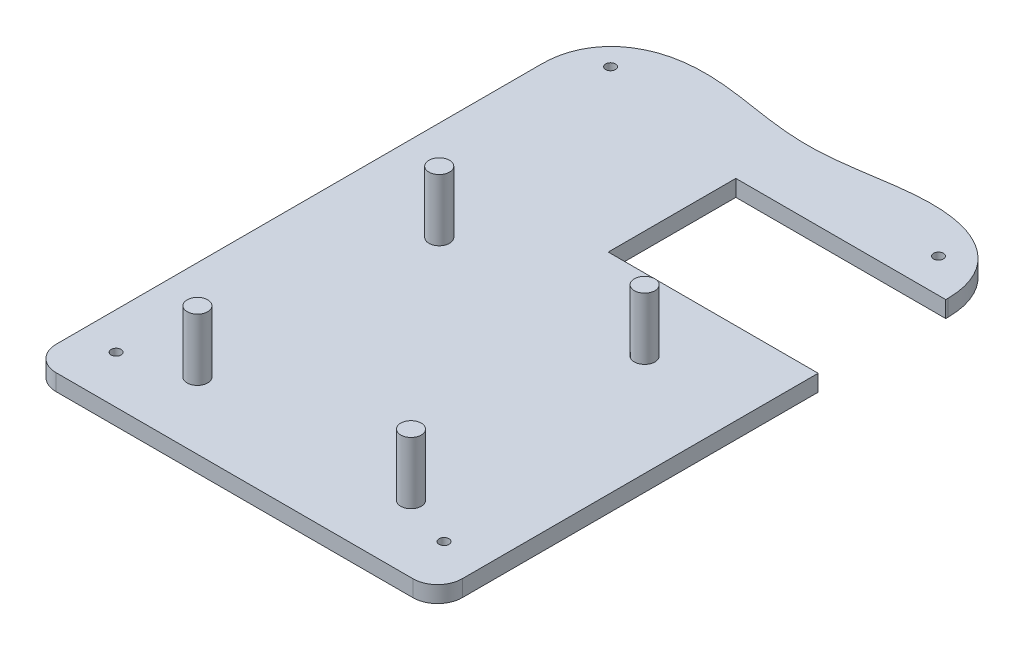
ISO-10303-21;
HEADER;
FILE_DESCRIPTION(('STEP AP214'),'2;1');
FILE_NAME('part.step','',(''),(''),'','','');
FILE_SCHEMA(('AUTOMOTIVE_DESIGN { 1 0 10303 214 1 1 1 1 }'));
ENDSEC;
DATA;
#1=APPLICATION_CONTEXT('core data for automotive mechanical design processes');
#2=APPLICATION_PROTOCOL_DEFINITION('international standard','automotive_design',2000,#1);
#3=PRODUCT_CONTEXT('',#1,'mechanical');
#4=PRODUCT('Part','Part','',(#3));
#5=PRODUCT_RELATED_PRODUCT_CATEGORY('part','',(#4));
#6=PRODUCT_DEFINITION_FORMATION('','',#4);
#7=PRODUCT_DEFINITION_CONTEXT('part definition',#1,'design');
#8=PRODUCT_DEFINITION('design','',#6,#7);
#9=PRODUCT_DEFINITION_SHAPE('','',#8);
#10=(LENGTH_UNIT() NAMED_UNIT(*) SI_UNIT(.MILLI.,.METRE.));
#11=(NAMED_UNIT(*) PLANE_ANGLE_UNIT() SI_UNIT($,.RADIAN.));
#12=(NAMED_UNIT(*) SI_UNIT($,.STERADIAN.) SOLID_ANGLE_UNIT());
#13=UNCERTAINTY_MEASURE_WITH_UNIT(LENGTH_MEASURE(1.E-05),#10,'distance_accuracy_value','');
#14=(GEOMETRIC_REPRESENTATION_CONTEXT(3) GLOBAL_UNCERTAINTY_ASSIGNED_CONTEXT((#13)) GLOBAL_UNIT_ASSIGNED_CONTEXT((#10,
#11,#12)) REPRESENTATION_CONTEXT('',''));
#15=CARTESIAN_POINT('',(0.,0.,0.));
#16=DIRECTION('',(0.,0.,1.));
#17=DIRECTION('',(1.,0.,0.));
#18=AXIS2_PLACEMENT_3D('',#15,#16,#17);
#19=CARTESIAN_POINT('',(100.76977648892,0.,-14.2329809142949));
#20=DIRECTION('',(0.,1.,0.));
#21=DIRECTION('',(0.,0.,1.));
#22=AXIS2_PLACEMENT_3D('',#19,#20,#21);
#23=PLANE('',#22);
#24=CARTESIAN_POINT('',(17.0587069179788,0.,-139.962329176477));
#25=DIRECTION('',(0.,-1.,0.));
#26=DIRECTION('',(0.,0.,-1.));
#27=AXIS2_PLACEMENT_3D('',#24,#25,#26);
#28=CIRCLE('',#27,2.2);
#29=CARTESIAN_POINT('',(17.0587069179788,0.,-142.162329176477));
#30=VERTEX_POINT('',#29);
#31=EDGE_CURVE('E191',#30,#30,#28,.T.);
#32=ORIENTED_EDGE('',*,*,#31,.F.);
#33=EDGE_LOOP('',(#32));
#34=FACE_BOUND('',#33,.T.);
#35=CARTESIAN_POINT('',(17.0587069179788,0.,-19.8367794215031));
#36=DIRECTION('',(0.,-1.,0.));
#37=DIRECTION('',(0.,0.,-1.));
#38=AXIS2_PLACEMENT_3D('',#35,#36,#37);
#39=CIRCLE('',#38,2.2);
#40=CARTESIAN_POINT('',(17.0587069179788,0.,-22.0367794215031));
#41=VERTEX_POINT('',#40);
#42=EDGE_CURVE('E195',#41,#41,#39,.T.);
#43=ORIENTED_EDGE('',*,*,#42,.F.);
#44=EDGE_LOOP('',(#43));
#45=FACE_BOUND('',#44,.T.);
#46=CARTESIAN_POINT('',(96.7401733982882,0.,-19.8367794215031));
#47=DIRECTION('',(0.,-1.,0.));
#48=DIRECTION('',(0.,0.,-1.));
#49=AXIS2_PLACEMENT_3D('',#46,#47,#48);
#50=CIRCLE('',#49,2.20000000000001);
#51=CARTESIAN_POINT('',(96.7401733982882,0.,-22.0367794215031));
#52=VERTEX_POINT('',#51);
#53=EDGE_CURVE('E199',#52,#52,#50,.T.);
#54=ORIENTED_EDGE('',*,*,#53,.F.);
#55=EDGE_LOOP('',(#54));
#56=FACE_BOUND('',#55,.T.);
#57=DIRECTION('',(0.,0.,1.));
#58=VECTOR('',#57,1.);
#59=CARTESIAN_POINT('',(55.7697764889205,0.,-14.2329809142949));
#60=LINE('',#59,#58);
#61=CARTESIAN_POINT('',(55.7697764889205,0.,-131.701924425202));
#62=VERTEX_POINT('',#61);
#63=CARTESIAN_POINT('',(55.7697764889205,0.,-100.701924425202));
#64=VERTEX_POINT('',#63);
#65=EDGE_CURVE('E48',#62,#64,#60,.T.);
#66=ORIENTED_EDGE('',*,*,#65,.T.);
#67=DIRECTION('',(1.,0.,0.));
#68=VECTOR('',#67,1.);
#69=CARTESIAN_POINT('',(100.76977648892,0.,-100.701924425202));
#70=LINE('',#69,#68);
#71=CARTESIAN_POINT('',(106.76977648892,0.,-100.701924425202));
#72=VERTEX_POINT('',#71);
#73=EDGE_CURVE('E11',#64,#72,#70,.T.);
#74=ORIENTED_EDGE('',*,*,#73,.T.);
#75=DIRECTION('',(0.,0.,1.));
#76=VECTOR('',#75,1.);
#77=CARTESIAN_POINT('',(106.76977648892,0.,-132.225547149591));
#78=LINE('',#77,#76);
#79=CARTESIAN_POINT('',(106.76977648892,0.,-14.2329809142949));
#80=VERTEX_POINT('',#79);
#81=EDGE_CURVE('E288',#72,#80,#78,.T.);
#82=ORIENTED_EDGE('',*,*,#81,.T.);
#83=CARTESIAN_POINT('',(100.76977648892,0.,-14.2329809142949));
#84=DIRECTION('',(0.,1.,0.));
#85=DIRECTION('',(0.,0.,1.));
#86=AXIS2_PLACEMENT_3D('',#83,#84,#85);
#87=CIRCLE('',#86,6.00000000000001);
#88=CARTESIAN_POINT('',(100.76977648892,0.,-8.23298091429488));
#89=VERTEX_POINT('',#88);
#90=EDGE_CURVE('E301',#89,#80,#87,.T.);
#91=ORIENTED_EDGE('',*,*,#90,.F.);
#92=DIRECTION('',(1.,0.,0.));
#93=VECTOR('',#92,1.);
#94=CARTESIAN_POINT('',(14.0910979071393,0.,-8.23298091429488));
#95=LINE('',#94,#93);
#96=CARTESIAN_POINT('',(14.0910979071393,0.,-8.23298091429488));
#97=VERTEX_POINT('',#96);
#98=EDGE_CURVE('E594',#97,#89,#95,.T.);
#99=ORIENTED_EDGE('',*,*,#98,.F.);
#100=CARTESIAN_POINT('',(14.0910979071393,0.,-14.2329809142949));
#101=DIRECTION('',(0.,1.,0.));
#102=DIRECTION('',(0.,0.,1.));
#103=AXIS2_PLACEMENT_3D('',#100,#101,#102);
#104=CIRCLE('',#103,6.);
#105=CARTESIAN_POINT('',(8.09109790713925,0.,-14.2329809142949));
#106=VERTEX_POINT('',#105);
#107=EDGE_CURVE('E606',#106,#97,#104,.T.);
#108=ORIENTED_EDGE('',*,*,#107,.F.);
#109=DIRECTION('',(0.,0.,1.));
#110=VECTOR('',#109,1.);
#111=CARTESIAN_POINT('',(8.09109790713925,0.,-132.236386797508));
#112=LINE('',#111,#110);
#113=CARTESIAN_POINT('',(8.09109790713925,0.,-132.236386797508));
#114=VERTEX_POINT('',#113);
#115=EDGE_CURVE('E129',#114,#106,#112,.T.);
#116=ORIENTED_EDGE('',*,*,#115,.F.);
#117=CARTESIAN_POINT('',(106.76977648892,0.,-132.225547149591));
#118=CARTESIAN_POINT('',(106.76977648892,0.,-159.234690285289));
#119=CARTESIAN_POINT('',(66.7697764889205,0.,-155.557917258713));
#120=CARTESIAN_POINT('',(71.3697764889205,0.,-140.524437357371));
#121=CARTESIAN_POINT('',(43.4910979071392,0.,-140.524437357371));
#122=CARTESIAN_POINT('',(48.0910979071393,0.,-155.557917258713));
#123=CARTESIAN_POINT('',(8.09109790713925,0.,-159.234690285289));
#124=CARTESIAN_POINT('',(8.09109790713925,0.,-132.236386797508));
#125=B_SPLINE_CURVE_WITH_KNOTS('',7,(#117,#118,#119,#120,#121,#122,#123,#124),.UNSPECIFIED.,.F.,
.F.,(8,8),(0.,1.),.UNSPECIFIED.);
#126=CARTESIAN_POINT('',(106.76977648892,0.,-132.225547149591));
#127=VERTEX_POINT('',#126);
#128=EDGE_CURVE('E590',#127,#114,#125,.T.);
#129=ORIENTED_EDGE('',*,*,#128,.F.);
#130=CARTESIAN_POINT('',(106.76977648892,0.,-131.701924425202));
#131=VERTEX_POINT('',#130);
#132=EDGE_CURVE('E153',#127,#131,#78,.T.);
#133=ORIENTED_EDGE('',*,*,#132,.T.);
#134=DIRECTION('',(-1.,0.,0.));
#135=VECTOR('',#134,1.);
#136=CARTESIAN_POINT('',(100.76977648892,0.,-131.701924425202));
#137=LINE('',#136,#135);
#138=EDGE_CURVE('E310',#131,#62,#137,.T.);
#139=ORIENTED_EDGE('',*,*,#138,.T.);
#140=EDGE_LOOP('',(#66,#74,#82,#91,#99,#108,#116,#129,#133,#139));
#141=FACE_BOUND('',#140,.T.);
#142=CARTESIAN_POINT('',(96.7401733982882,0.,-139.962329176477));
#143=DIRECTION('',(0.,-1.,0.));
#144=DIRECTION('',(0.,0.,-1.));
#145=AXIS2_PLACEMENT_3D('',#142,#143,#144);
#146=CIRCLE('',#145,2.20000000000001);
#147=CARTESIAN_POINT('',(96.7401733982882,0.,-142.162329176477));
#148=VERTEX_POINT('',#147);
#149=EDGE_CURVE('E206',#148,#148,#146,.T.);
#150=ORIENTED_EDGE('',*,*,#149,.F.);
#151=EDGE_LOOP('',(#150));
#152=FACE_BOUND('',#151,.T.);
#153=ADVANCED_FACE('F38',(#34,#45,#56,#141,#152),#23,.F.);
#154=CARTESIAN_POINT('',(106.76977648892,4.,-132.225547149591));
#155=DIRECTION('',(1.,0.,0.));
#156=DIRECTION('',(0.,0.,-1.));
#157=AXIS2_PLACEMENT_3D('',#154,#155,#156);
#158=PLANE('',#157);
#159=DIRECTION('',(0.,1.,0.));
#160=VECTOR('',#159,1.);
#161=CARTESIAN_POINT('',(106.76977648892,-11.,-100.701924425202));
#162=LINE('',#161,#160);
#163=CARTESIAN_POINT('',(106.76977648892,4.,-100.701924425202));
#164=VERTEX_POINT('',#163);
#165=EDGE_CURVE('E247',#72,#164,#162,.T.);
#166=ORIENTED_EDGE('',*,*,#165,.T.);
#167=DIRECTION('',(0.,0.,1.));
#168=VECTOR('',#167,1.);
#169=CARTESIAN_POINT('',(106.76977648892,4.,-132.225547149591));
#170=LINE('',#169,#168);
#171=CARTESIAN_POINT('',(106.76977648892,4.,-14.2329809142949));
#172=VERTEX_POINT('',#171);
#173=EDGE_CURVE('E98',#164,#172,#170,.T.);
#174=ORIENTED_EDGE('',*,*,#173,.T.);
#175=DIRECTION('',(0.,-1.,0.));
#176=VECTOR('',#175,1.);
#177=CARTESIAN_POINT('',(106.76977648892,4.,-14.2329809142949));
#178=LINE('',#177,#176);
#179=EDGE_CURVE('E152',#172,#80,#178,.T.);
#180=ORIENTED_EDGE('',*,*,#179,.T.);
#181=ORIENTED_EDGE('',*,*,#81,.F.);
#182=EDGE_LOOP('',(#166,#174,#180,#181));
#183=FACE_BOUND('',#182,.T.);
#184=ADVANCED_FACE('F182',(#183),#158,.T.);
#185=DIRECTION('',(0.,1.,0.));
#186=VECTOR('',#185,1.);
#187=CARTESIAN_POINT('',(106.76977648892,-11.,-131.701924425202));
#188=LINE('',#187,#186);
#189=CARTESIAN_POINT('',(106.76977648892,4.,-131.701924425202));
#190=VERTEX_POINT('',#189);
#191=EDGE_CURVE('E246',#131,#190,#188,.T.);
#192=ORIENTED_EDGE('',*,*,#191,.F.);
#193=ORIENTED_EDGE('',*,*,#132,.F.);
#194=DIRECTION('',(0.,-1.,0.));
#195=VECTOR('',#194,1.);
#196=CARTESIAN_POINT('',(106.76977648892,4.,-132.225547149591));
#197=LINE('',#196,#195);
#198=CARTESIAN_POINT('',(106.76977648892,4.,-132.225547149591));
#199=VERTEX_POINT('',#198);
#200=EDGE_CURVE('E65',#199,#127,#197,.T.);
#201=ORIENTED_EDGE('',*,*,#200,.F.);
#202=EDGE_CURVE('E292',#199,#190,#170,.T.);
#203=ORIENTED_EDGE('',*,*,#202,.T.);
#204=EDGE_LOOP('',(#192,#193,#201,#203));
#205=FACE_BOUND('',#204,.T.);
#206=ADVANCED_FACE('F40',(#205),#158,.T.);
#207=CARTESIAN_POINT('',(106.76977648892,4.,-132.225547149591));
#208=CARTESIAN_POINT('',(106.76977648892,4.,-159.234690285289));
#209=CARTESIAN_POINT('',(66.7697764889205,4.,-155.557917258713));
#210=CARTESIAN_POINT('',(71.3697764889205,4.,-140.524437357371));
#211=CARTESIAN_POINT('',(43.4910979071392,4.,-140.524437357371));
#212=CARTESIAN_POINT('',(48.0910979071393,4.,-155.557917258713));
#213=CARTESIAN_POINT('',(8.09109790713925,4.,-159.234690285289));
#214=CARTESIAN_POINT('',(8.09109790713925,4.,-132.236386797508));
#215=B_SPLINE_CURVE_WITH_KNOTS('',7,(#207,#208,#209,#210,#211,#212,#213,#214),.UNSPECIFIED.,.F.,
.F.,(8,8),(0.,1.),.UNSPECIFIED.);
#216=DIRECTION('',(0.,-1.,0.));
#217=VECTOR('',#216,1.);
#218=SURFACE_OF_LINEAR_EXTRUSION('',#215,#217);
#219=ORIENTED_EDGE('',*,*,#128,.T.);
#220=DIRECTION('',(0.,-1.,0.));
#221=VECTOR('',#220,1.);
#222=CARTESIAN_POINT('',(8.09109790713925,4.,-132.236386797508));
#223=LINE('',#222,#221);
#224=CARTESIAN_POINT('',(8.09109790713925,4.,-132.236386797508));
#225=VERTEX_POINT('',#224);
#226=EDGE_CURVE('E133',#225,#114,#223,.T.);
#227=ORIENTED_EDGE('',*,*,#226,.F.);
#228=EDGE_CURVE('E119',#199,#225,#215,.T.);
#229=ORIENTED_EDGE('',*,*,#228,.F.);
#230=ORIENTED_EDGE('',*,*,#200,.T.);
#231=EDGE_LOOP('',(#219,#227,#229,#230));
#232=FACE_BOUND('',#231,.T.);
#233=ADVANCED_FACE('F159',(#232),#218,.F.);
#234=CARTESIAN_POINT('',(8.09109790713925,4.,-132.236386797508));
#235=DIRECTION('',(1.,0.,0.));
#236=DIRECTION('',(0.,0.,-1.));
#237=AXIS2_PLACEMENT_3D('',#234,#235,#236);
#238=PLANE('',#237);
#239=ORIENTED_EDGE('',*,*,#115,.T.);
#240=DIRECTION('',(0.,-1.,0.));
#241=VECTOR('',#240,1.);
#242=CARTESIAN_POINT('',(8.09109790713925,4.,-14.2329809142949));
#243=LINE('',#242,#241);
#244=CARTESIAN_POINT('',(8.09109790713925,4.,-14.2329809142949));
#245=VERTEX_POINT('',#244);
#246=EDGE_CURVE('E126',#245,#106,#243,.T.);
#247=ORIENTED_EDGE('',*,*,#246,.F.);
#248=DIRECTION('',(0.,0.,1.));
#249=VECTOR('',#248,1.);
#250=CARTESIAN_POINT('',(8.09109790713925,4.,-132.236386797508));
#251=LINE('',#250,#249);
#252=EDGE_CURVE('E110',#225,#245,#251,.T.);
#253=ORIENTED_EDGE('',*,*,#252,.F.);
#254=ORIENTED_EDGE('',*,*,#226,.T.);
#255=EDGE_LOOP('',(#239,#247,#253,#254));
#256=FACE_BOUND('',#255,.T.);
#257=ADVANCED_FACE('F127',(#256),#238,.F.);
#258=CARTESIAN_POINT('',(14.0910979071393,4.,-14.2329809142949));
#259=DIRECTION('',(0.,-1.,0.));
#260=DIRECTION('',(0.,0.,-1.));
#261=AXIS2_PLACEMENT_3D('',#258,#259,#260);
#262=CYLINDRICAL_SURFACE('',#261,6.);
#263=ORIENTED_EDGE('',*,*,#107,.T.);
#264=DIRECTION('',(0.,-1.,0.));
#265=VECTOR('',#264,1.);
#266=CARTESIAN_POINT('',(14.0910979071393,4.,-8.23298091429488));
#267=LINE('',#266,#265);
#268=CARTESIAN_POINT('',(14.0910979071393,4.,-8.23298091429488));
#269=VERTEX_POINT('',#268);
#270=EDGE_CURVE('E134',#269,#97,#267,.T.);
#271=ORIENTED_EDGE('',*,*,#270,.F.);
#272=CARTESIAN_POINT('',(14.0910979071393,4.,-14.2329809142949));
#273=DIRECTION('',(0.,1.,0.));
#274=DIRECTION('',(0.,0.,1.));
#275=AXIS2_PLACEMENT_3D('',#272,#273,#274);
#276=CIRCLE('',#275,6.);
#277=EDGE_CURVE('E116',#245,#269,#276,.T.);
#278=ORIENTED_EDGE('',*,*,#277,.F.);
#279=ORIENTED_EDGE('',*,*,#246,.T.);
#280=EDGE_LOOP('',(#263,#271,#278,#279));
#281=FACE_BOUND('',#280,.T.);
#282=ADVANCED_FACE('F136',(#281),#262,.T.);
#283=CARTESIAN_POINT('',(14.0910979071393,4.,-8.23298091429488));
#284=DIRECTION('',(0.,0.,-1.));
#285=DIRECTION('',(-1.,0.,0.));
#286=AXIS2_PLACEMENT_3D('',#283,#284,#285);
#287=PLANE('',#286);
#288=ORIENTED_EDGE('',*,*,#98,.T.);
#289=DIRECTION('',(0.,-1.,0.));
#290=VECTOR('',#289,1.);
#291=CARTESIAN_POINT('',(100.76977648892,4.,-8.23298091429488));
#292=LINE('',#291,#290);
#293=CARTESIAN_POINT('',(100.76977648892,4.,-8.23298091429488));
#294=VERTEX_POINT('',#293);
#295=EDGE_CURVE('E304',#294,#89,#292,.T.);
#296=ORIENTED_EDGE('',*,*,#295,.F.);
#297=DIRECTION('',(1.,0.,0.));
#298=VECTOR('',#297,1.);
#299=CARTESIAN_POINT('',(14.0910979071393,4.,-8.23298091429488));
#300=LINE('',#299,#298);
#301=EDGE_CURVE('E140',#269,#294,#300,.T.);
#302=ORIENTED_EDGE('',*,*,#301,.F.);
#303=ORIENTED_EDGE('',*,*,#270,.T.);
#304=EDGE_LOOP('',(#288,#296,#302,#303));
#305=FACE_BOUND('',#304,.T.);
#306=ADVANCED_FACE('F168',(#305),#287,.F.);
#307=CARTESIAN_POINT('',(100.76977648892,4.,-14.2329809142949));
#308=DIRECTION('',(0.,-1.,0.));
#309=DIRECTION('',(0.,0.,-1.));
#310=AXIS2_PLACEMENT_3D('',#307,#308,#309);
#311=CYLINDRICAL_SURFACE('',#310,6.00000000000001);
#312=ORIENTED_EDGE('',*,*,#90,.T.);
#313=ORIENTED_EDGE('',*,*,#179,.F.);
#314=CARTESIAN_POINT('',(100.76977648892,4.,-14.2329809142949));
#315=DIRECTION('',(0.,1.,0.));
#316=DIRECTION('',(0.,0.,1.));
#317=AXIS2_PLACEMENT_3D('',#314,#315,#316);
#318=CIRCLE('',#317,6.00000000000001);
#319=EDGE_CURVE('E143',#294,#172,#318,.T.);
#320=ORIENTED_EDGE('',*,*,#319,.F.);
#321=ORIENTED_EDGE('',*,*,#295,.T.);
#322=EDGE_LOOP('',(#312,#313,#320,#321));
#323=FACE_BOUND('',#322,.T.);
#324=ADVANCED_FACE('F170',(#323),#311,.T.);
#325=CARTESIAN_POINT('',(100.76977648892,4.,-14.2329809142949));
#326=DIRECTION('',(0.,1.,0.));
#327=DIRECTION('',(0.,0.,1.));
#328=AXIS2_PLACEMENT_3D('',#325,#326,#327);
#329=PLANE('',#328);
#330=CARTESIAN_POINT('',(17.0587069179788,4.,-139.962329176477));
#331=DIRECTION('',(0.,1.,0.));
#332=DIRECTION('',(0.,0.,1.));
#333=AXIS2_PLACEMENT_3D('',#330,#331,#332);
#334=CIRCLE('',#333,1.19999999999999);
#335=CARTESIAN_POINT('',(17.0587069179788,4.,-138.762329176477));
#336=VERTEX_POINT('',#335);
#337=EDGE_CURVE('E42',#336,#336,#334,.T.);
#338=ORIENTED_EDGE('',*,*,#337,.F.);
#339=EDGE_LOOP('',(#338));
#340=FACE_BOUND('',#339,.T.);
#341=CARTESIAN_POINT('',(96.7401733982882,4.,-139.962329176477));
#342=DIRECTION('',(0.,1.,0.));
#343=DIRECTION('',(0.,0.,1.));
#344=AXIS2_PLACEMENT_3D('',#341,#342,#343);
#345=CIRCLE('',#344,1.19999999999999);
#346=CARTESIAN_POINT('',(96.7401733982882,4.,-138.762329176477));
#347=VERTEX_POINT('',#346);
#348=EDGE_CURVE('E214',#347,#347,#345,.T.);
#349=ORIENTED_EDGE('',*,*,#348,.F.);
#350=EDGE_LOOP('',(#349));
#351=FACE_BOUND('',#350,.T.);
#352=CARTESIAN_POINT('',(17.0587069179788,4.,-19.8367794215031));
#353=DIRECTION('',(0.,1.,0.));
#354=DIRECTION('',(0.,0.,1.));
#355=AXIS2_PLACEMENT_3D('',#352,#353,#354);
#356=CIRCLE('',#355,1.19999999999999);
#357=CARTESIAN_POINT('',(17.0587069179788,4.,-18.6367794215031));
#358=VERTEX_POINT('',#357);
#359=EDGE_CURVE('E227',#358,#358,#356,.T.);
#360=ORIENTED_EDGE('',*,*,#359,.F.);
#361=EDGE_LOOP('',(#360));
#362=FACE_BOUND('',#361,.T.);
#363=CARTESIAN_POINT('',(96.7401733982882,4.,-19.8367794215031));
#364=DIRECTION('',(0.,1.,0.));
#365=DIRECTION('',(0.,0.,1.));
#366=AXIS2_PLACEMENT_3D('',#363,#364,#365);
#367=CIRCLE('',#366,1.19999999999999);
#368=CARTESIAN_POINT('',(96.7401733982882,4.,-18.6367794215031));
#369=VERTEX_POINT('',#368);
#370=EDGE_CURVE('E234',#369,#369,#367,.T.);
#371=ORIENTED_EDGE('',*,*,#370,.F.);
#372=EDGE_LOOP('',(#371));
#373=FACE_BOUND('',#372,.T.);
#374=DIRECTION('',(1.,0.,0.));
#375=VECTOR('',#374,1.);
#376=CARTESIAN_POINT('',(106.76977648892,4.,-100.701924425202));
#377=LINE('',#376,#375);
#378=CARTESIAN_POINT('',(55.7697764889205,4.,-100.701924425202));
#379=VERTEX_POINT('',#378);
#380=EDGE_CURVE('E242',#379,#164,#377,.T.);
#381=ORIENTED_EDGE('',*,*,#380,.F.);
#382=DIRECTION('',(0.,0.,1.));
#383=VECTOR('',#382,1.);
#384=CARTESIAN_POINT('',(55.7697764889205,4.,-100.701924425202));
#385=LINE('',#384,#383);
#386=CARTESIAN_POINT('',(55.7697764889205,4.,-131.701924425202));
#387=VERTEX_POINT('',#386);
#388=EDGE_CURVE('E238',#387,#379,#385,.T.);
#389=ORIENTED_EDGE('',*,*,#388,.F.);
#390=DIRECTION('',(-1.,0.,0.));
#391=VECTOR('',#390,1.);
#392=CARTESIAN_POINT('',(106.76977648892,4.,-131.701924425202));
#393=LINE('',#392,#391);
#394=EDGE_CURVE('E235',#190,#387,#393,.T.);
#395=ORIENTED_EDGE('',*,*,#394,.F.);
#396=ORIENTED_EDGE('',*,*,#202,.F.);
#397=ORIENTED_EDGE('',*,*,#228,.T.);
#398=ORIENTED_EDGE('',*,*,#252,.T.);
#399=ORIENTED_EDGE('',*,*,#277,.T.);
#400=ORIENTED_EDGE('',*,*,#301,.T.);
#401=ORIENTED_EDGE('',*,*,#319,.T.);
#402=ORIENTED_EDGE('',*,*,#173,.F.);
#403=EDGE_LOOP('',(#381,#389,#395,#396,#397,#398,#399,#400,#401,#402));
#404=FACE_BOUND('',#403,.T.);
#405=CARTESIAN_POINT('',(84.0537083443801,4.,-24.4917491704997));
#406=DIRECTION('',(0.,1.,0.));
#407=DIRECTION('',(0.,0.,1.));
#408=AXIS2_PLACEMENT_3D('',#405,#406,#407);
#409=CIRCLE('',#408,2.50000000000001);
#410=CARTESIAN_POINT('',(84.0537083443801,4.,-21.9917491704997));
#411=VERTEX_POINT('',#410);
#412=EDGE_CURVE('E250',#411,#411,#409,.T.);
#413=ORIENTED_EDGE('',*,*,#412,.F.);
#414=EDGE_LOOP('',(#413));
#415=FACE_BOUND('',#414,.T.);
#416=CARTESIAN_POINT('',(32.1619729057827,4.,-24.4917491704997));
#417=DIRECTION('',(0.,1.,0.));
#418=DIRECTION('',(0.,0.,1.));
#419=AXIS2_PLACEMENT_3D('',#416,#417,#418);
#420=CIRCLE('',#419,2.5);
#421=CARTESIAN_POINT('',(32.1619729057827,4.,-21.9917491704997));
#422=VERTEX_POINT('',#421);
#423=EDGE_CURVE('E264',#422,#422,#420,.T.);
#424=ORIENTED_EDGE('',*,*,#423,.F.);
#425=EDGE_LOOP('',(#424));
#426=FACE_BOUND('',#425,.T.);
#427=CARTESIAN_POINT('',(82.0671898829709,4.,-83.2409286499744));
#428=DIRECTION('',(0.,1.,0.));
#429=DIRECTION('',(0.,0.,1.));
#430=AXIS2_PLACEMENT_3D('',#427,#428,#429);
#431=CIRCLE('',#430,2.5);
#432=CARTESIAN_POINT('',(82.0671898829709,4.,-80.7409286499744));
#433=VERTEX_POINT('',#432);
#434=EDGE_CURVE('E272',#433,#433,#431,.T.);
#435=ORIENTED_EDGE('',*,*,#434,.F.);
#436=EDGE_LOOP('',(#435));
#437=FACE_BOUND('',#436,.T.);
#438=CARTESIAN_POINT('',(32.1619729057827,4.,-83.2409286499744));
#439=DIRECTION('',(0.,1.,0.));
#440=DIRECTION('',(0.,0.,1.));
#441=AXIS2_PLACEMENT_3D('',#438,#439,#440);
#442=CIRCLE('',#441,2.5);
#443=CARTESIAN_POINT('',(32.1619729057827,4.,-80.7409286499744));
#444=VERTEX_POINT('',#443);
#445=EDGE_CURVE('E280',#444,#444,#442,.T.);
#446=ORIENTED_EDGE('',*,*,#445,.F.);
#447=EDGE_LOOP('',(#446));
#448=FACE_BOUND('',#447,.T.);
#449=ADVANCED_FACE('F113',(#340,#351,#362,#373,#404,#415,#426,#437,#448),#329,.T.);
#450=CARTESIAN_POINT('',(32.1619729057827,19.,-83.2409286499744));
#451=DIRECTION('',(0.,-1.,0.));
#452=DIRECTION('',(0.,0.,-1.));
#453=AXIS2_PLACEMENT_3D('',#450,#451,#452);
#454=CYLINDRICAL_SURFACE('',#453,2.5);
#455=CARTESIAN_POINT('',(32.1619729057827,19.,-83.2409286499744));
#456=DIRECTION('',(0.,1.,0.));
#457=DIRECTION('',(0.,0.,1.));
#458=AXIS2_PLACEMENT_3D('',#455,#456,#457);
#459=CIRCLE('',#458,2.5);
#460=CARTESIAN_POINT('',(32.1619729057827,19.,-80.7409286499744));
#461=VERTEX_POINT('',#460);
#462=EDGE_CURVE('E284',#461,#461,#459,.T.);
#463=ORIENTED_EDGE('',*,*,#462,.F.);
#464=EDGE_LOOP('',(#463));
#465=FACE_BOUND('',#464,.T.);
#466=ORIENTED_EDGE('',*,*,#445,.T.);
#467=EDGE_LOOP('',(#466));
#468=FACE_BOUND('',#467,.T.);
#469=ADVANCED_FACE('F178',(#465,#468),#454,.T.);
#470=CARTESIAN_POINT('',(32.1619729057827,19.,-83.2409286499744));
#471=DIRECTION('',(0.,1.,0.));
#472=DIRECTION('',(0.,0.,1.));
#473=AXIS2_PLACEMENT_3D('',#470,#471,#472);
#474=PLANE('',#473);
#475=ORIENTED_EDGE('',*,*,#462,.T.);
#476=EDGE_LOOP('',(#475));
#477=FACE_BOUND('',#476,.T.);
#478=ADVANCED_FACE('F385',(#477),#474,.T.);
#479=CARTESIAN_POINT('',(82.0671898829709,19.,-83.2409286499744));
#480=DIRECTION('',(0.,-1.,0.));
#481=DIRECTION('',(0.,0.,-1.));
#482=AXIS2_PLACEMENT_3D('',#479,#480,#481);
#483=CYLINDRICAL_SURFACE('',#482,2.5);
#484=CARTESIAN_POINT('',(82.0671898829709,19.,-83.2409286499744));
#485=DIRECTION('',(0.,1.,0.));
#486=DIRECTION('',(0.,0.,1.));
#487=AXIS2_PLACEMENT_3D('',#484,#485,#486);
#488=CIRCLE('',#487,2.5);
#489=CARTESIAN_POINT('',(82.0671898829709,19.,-80.7409286499744));
#490=VERTEX_POINT('',#489);
#491=EDGE_CURVE('E276',#490,#490,#488,.T.);
#492=ORIENTED_EDGE('',*,*,#491,.F.);
#493=EDGE_LOOP('',(#492));
#494=FACE_BOUND('',#493,.T.);
#495=ORIENTED_EDGE('',*,*,#434,.T.);
#496=EDGE_LOOP('',(#495));
#497=FACE_BOUND('',#496,.T.);
#498=ADVANCED_FACE('F381',(#494,#497),#483,.T.);
#499=CARTESIAN_POINT('',(82.0671898829709,19.,-83.2409286499744));
#500=DIRECTION('',(0.,1.,0.));
#501=DIRECTION('',(0.,0.,1.));
#502=AXIS2_PLACEMENT_3D('',#499,#500,#501);
#503=PLANE('',#502);
#504=ORIENTED_EDGE('',*,*,#491,.T.);
#505=EDGE_LOOP('',(#504));
#506=FACE_BOUND('',#505,.T.);
#507=ADVANCED_FACE('F377',(#506),#503,.T.);
#508=CARTESIAN_POINT('',(32.1619729057827,19.,-24.4917491704997));
#509=DIRECTION('',(0.,-1.,0.));
#510=DIRECTION('',(0.,0.,-1.));
#511=AXIS2_PLACEMENT_3D('',#508,#509,#510);
#512=CYLINDRICAL_SURFACE('',#511,2.5);
#513=CARTESIAN_POINT('',(32.1619729057827,19.,-24.4917491704997));
#514=DIRECTION('',(0.,1.,0.));
#515=DIRECTION('',(0.,0.,1.));
#516=AXIS2_PLACEMENT_3D('',#513,#514,#515);
#517=CIRCLE('',#516,2.5);
#518=CARTESIAN_POINT('',(32.1619729057827,19.,-21.9917491704997));
#519=VERTEX_POINT('',#518);
#520=EDGE_CURVE('E268',#519,#519,#517,.T.);
#521=ORIENTED_EDGE('',*,*,#520,.F.);
#522=EDGE_LOOP('',(#521));
#523=FACE_BOUND('',#522,.T.);
#524=ORIENTED_EDGE('',*,*,#423,.T.);
#525=EDGE_LOOP('',(#524));
#526=FACE_BOUND('',#525,.T.);
#527=ADVANCED_FACE('F373',(#523,#526),#512,.T.);
#528=CARTESIAN_POINT('',(32.1619729057827,19.,-24.4917491704997));
#529=DIRECTION('',(0.,1.,0.));
#530=DIRECTION('',(0.,0.,1.));
#531=AXIS2_PLACEMENT_3D('',#528,#529,#530);
#532=PLANE('',#531);
#533=ORIENTED_EDGE('',*,*,#520,.T.);
#534=EDGE_LOOP('',(#533));
#535=FACE_BOUND('',#534,.T.);
#536=ADVANCED_FACE('F369',(#535),#532,.T.);
#537=CARTESIAN_POINT('',(84.0537083443801,19.,-24.4917491704997));
#538=DIRECTION('',(0.,-1.,0.));
#539=DIRECTION('',(0.,0.,-1.));
#540=AXIS2_PLACEMENT_3D('',#537,#538,#539);
#541=CYLINDRICAL_SURFACE('',#540,2.50000000000001);
#542=CARTESIAN_POINT('',(84.0537083443801,19.,-24.4917491704997));
#543=DIRECTION('',(0.,1.,0.));
#544=DIRECTION('',(0.,0.,1.));
#545=AXIS2_PLACEMENT_3D('',#542,#543,#544);
#546=CIRCLE('',#545,2.50000000000001);
#547=CARTESIAN_POINT('',(84.0537083443801,19.,-21.9917491704997));
#548=VERTEX_POINT('',#547);
#549=EDGE_CURVE('E260',#548,#548,#546,.T.);
#550=ORIENTED_EDGE('',*,*,#549,.F.);
#551=EDGE_LOOP('',(#550));
#552=FACE_BOUND('',#551,.T.);
#553=ORIENTED_EDGE('',*,*,#412,.T.);
#554=EDGE_LOOP('',(#553));
#555=FACE_BOUND('',#554,.T.);
#556=ADVANCED_FACE('F365',(#552,#555),#541,.T.);
#557=CARTESIAN_POINT('',(84.0537083443801,19.,-24.4917491704997));
#558=DIRECTION('',(0.,1.,0.));
#559=DIRECTION('',(0.,0.,1.));
#560=AXIS2_PLACEMENT_3D('',#557,#558,#559);
#561=PLANE('',#560);
#562=ORIENTED_EDGE('',*,*,#549,.T.);
#563=EDGE_LOOP('',(#562));
#564=FACE_BOUND('',#563,.T.);
#565=ADVANCED_FACE('F356',(#564),#561,.T.);
#566=CARTESIAN_POINT('',(106.76977648892,-11.,-100.701924425202));
#567=DIRECTION('',(0.,0.,1.));
#568=DIRECTION('',(1.,0.,0.));
#569=AXIS2_PLACEMENT_3D('',#566,#567,#568);
#570=PLANE('',#569);
#571=DIRECTION('',(0.,1.,0.));
#572=VECTOR('',#571,1.);
#573=CARTESIAN_POINT('',(55.7697764889205,-11.,-100.701924425202));
#574=LINE('',#573,#572);
#575=EDGE_CURVE('E251',#64,#379,#574,.T.);
#576=ORIENTED_EDGE('',*,*,#575,.T.);
#577=ORIENTED_EDGE('',*,*,#380,.T.);
#578=ORIENTED_EDGE('',*,*,#165,.F.);
#579=ORIENTED_EDGE('',*,*,#73,.F.);
#580=EDGE_LOOP('',(#576,#577,#578,#579));
#581=FACE_BOUND('',#580,.T.);
#582=ADVANCED_FACE('F352',(#581),#570,.F.);
#583=CARTESIAN_POINT('',(55.7697764889205,-11.,-100.701924425202));
#584=DIRECTION('',(-1.,0.,0.));
#585=DIRECTION('',(0.,0.,1.));
#586=AXIS2_PLACEMENT_3D('',#583,#584,#585);
#587=PLANE('',#586);
#588=DIRECTION('',(0.,1.,0.));
#589=VECTOR('',#588,1.);
#590=CARTESIAN_POINT('',(55.7697764889205,-11.,-131.701924425202));
#591=LINE('',#590,#589);
#592=EDGE_CURVE('E56',#62,#387,#591,.T.);
#593=ORIENTED_EDGE('',*,*,#592,.T.);
#594=ORIENTED_EDGE('',*,*,#388,.T.);
#595=ORIENTED_EDGE('',*,*,#575,.F.);
#596=ORIENTED_EDGE('',*,*,#65,.F.);
#597=EDGE_LOOP('',(#593,#594,#595,#596));
#598=FACE_BOUND('',#597,.T.);
#599=ADVANCED_FACE('F355',(#598),#587,.F.);
#600=CARTESIAN_POINT('',(106.76977648892,-11.,-131.701924425202));
#601=DIRECTION('',(0.,0.,-1.));
#602=DIRECTION('',(-1.,0.,0.));
#603=AXIS2_PLACEMENT_3D('',#600,#601,#602);
#604=PLANE('',#603);
#605=ORIENTED_EDGE('',*,*,#191,.T.);
#606=ORIENTED_EDGE('',*,*,#394,.T.);
#607=ORIENTED_EDGE('',*,*,#592,.F.);
#608=ORIENTED_EDGE('',*,*,#138,.F.);
#609=EDGE_LOOP('',(#605,#606,#607,#608));
#610=FACE_BOUND('',#609,.T.);
#611=ADVANCED_FACE('F336',(#610),#604,.F.);
#612=CARTESIAN_POINT('',(96.7401733982882,0.,-19.8367794215031));
#613=DIRECTION('',(0.,-1.,0.));
#614=DIRECTION('',(0.,0.,-1.));
#615=AXIS2_PLACEMENT_3D('',#612,#613,#614);
#616=CYLINDRICAL_SURFACE('',#615,1.19999999999999);
#617=ORIENTED_EDGE('',*,*,#370,.T.);
#618=EDGE_LOOP('',(#617));
#619=FACE_BOUND('',#618,.T.);
#620=CARTESIAN_POINT('',(96.7401733982882,1.00000000000001,-19.8367794215031));
#621=DIRECTION('',(0.,-1.,0.));
#622=DIRECTION('',(0.,0.,-1.));
#623=AXIS2_PLACEMENT_3D('',#620,#621,#622);
#624=CIRCLE('',#623,1.19999999999999);
#625=CARTESIAN_POINT('',(96.7401733982882,1.00000000000001,-21.0367794215031));
#626=VERTEX_POINT('',#625);
#627=EDGE_CURVE('E230',#626,#626,#624,.T.);
#628=ORIENTED_EDGE('',*,*,#627,.T.);
#629=EDGE_LOOP('',(#628));
#630=FACE_BOUND('',#629,.T.);
#631=ADVANCED_FACE('F332',(#619,#630),#616,.F.);
#632=CARTESIAN_POINT('',(96.7401733982882,0.,-19.8367794215031));
#633=DIRECTION('',(0.,-1.,0.));
#634=DIRECTION('',(0.,0.,-1.));
#635=AXIS2_PLACEMENT_3D('',#632,#633,#634);
#636=CONICAL_SURFACE('',#635,2.20000000000001,0.785398163397451);
#637=ORIENTED_EDGE('',*,*,#627,.F.);
#638=EDGE_LOOP('',(#637));
#639=FACE_BOUND('',#638,.T.);
#640=ORIENTED_EDGE('',*,*,#53,.T.);
#641=EDGE_LOOP('',(#640));
#642=FACE_BOUND('',#641,.T.);
#643=ADVANCED_FACE('F335',(#639,#642),#636,.F.);
#644=CARTESIAN_POINT('',(17.0587069179788,0.,-19.8367794215031));
#645=DIRECTION('',(0.,-1.,0.));
#646=DIRECTION('',(0.,0.,-1.));
#647=AXIS2_PLACEMENT_3D('',#644,#645,#646);
#648=CYLINDRICAL_SURFACE('',#647,1.19999999999999);
#649=ORIENTED_EDGE('',*,*,#359,.T.);
#650=EDGE_LOOP('',(#649));
#651=FACE_BOUND('',#650,.T.);
#652=CARTESIAN_POINT('',(17.0587069179788,1.00000000000001,-19.8367794215031));
#653=DIRECTION('',(0.,-1.,0.));
#654=DIRECTION('',(0.,0.,-1.));
#655=AXIS2_PLACEMENT_3D('',#652,#653,#654);
#656=CIRCLE('',#655,1.19999999999999);
#657=CARTESIAN_POINT('',(17.0587069179788,1.00000000000001,-21.0367794215031));
#658=VERTEX_POINT('',#657);
#659=EDGE_CURVE('E223',#658,#658,#656,.T.);
#660=ORIENTED_EDGE('',*,*,#659,.T.);
#661=EDGE_LOOP('',(#660));
#662=FACE_BOUND('',#661,.T.);
#663=ADVANCED_FACE('F342',(#651,#662),#648,.F.);
#664=CARTESIAN_POINT('',(17.0587069179788,0.,-19.8367794215031));
#665=DIRECTION('',(0.,-1.,0.));
#666=DIRECTION('',(0.,0.,-1.));
#667=AXIS2_PLACEMENT_3D('',#664,#665,#666);
#668=CONICAL_SURFACE('',#667,2.2,0.785398163397447);
#669=ORIENTED_EDGE('',*,*,#659,.F.);
#670=EDGE_LOOP('',(#669));
#671=FACE_BOUND('',#670,.T.);
#672=ORIENTED_EDGE('',*,*,#42,.T.);
#673=EDGE_LOOP('',(#672));
#674=FACE_BOUND('',#673,.T.);
#675=ADVANCED_FACE('F347',(#671,#674),#668,.F.);
#676=CARTESIAN_POINT('',(96.7401733982882,0.,-139.962329176477));
#677=DIRECTION('',(0.,-1.,0.));
#678=DIRECTION('',(0.,0.,-1.));
#679=AXIS2_PLACEMENT_3D('',#676,#677,#678);
#680=CYLINDRICAL_SURFACE('',#679,1.19999999999999);
#681=ORIENTED_EDGE('',*,*,#348,.T.);
#682=EDGE_LOOP('',(#681));
#683=FACE_BOUND('',#682,.T.);
#684=CARTESIAN_POINT('',(96.7401733982882,1.00000000000001,-139.962329176477));
#685=DIRECTION('',(0.,-1.,0.));
#686=DIRECTION('',(0.,0.,-1.));
#687=AXIS2_PLACEMENT_3D('',#684,#685,#686);
#688=CIRCLE('',#687,1.19999999999999);
#689=CARTESIAN_POINT('',(96.7401733982882,1.00000000000001,-141.162329176477));
#690=VERTEX_POINT('',#689);
#691=EDGE_CURVE('E209',#690,#690,#688,.T.);
#692=ORIENTED_EDGE('',*,*,#691,.T.);
#693=EDGE_LOOP('',(#692));
#694=FACE_BOUND('',#693,.T.);
#695=ADVANCED_FACE('F324',(#683,#694),#680,.F.);
#696=CARTESIAN_POINT('',(96.7401733982882,0.,-139.962329176477));
#697=DIRECTION('',(0.,-1.,0.));
#698=DIRECTION('',(0.,0.,-1.));
#699=AXIS2_PLACEMENT_3D('',#696,#697,#698);
#700=CONICAL_SURFACE('',#699,2.20000000000001,0.785398163397451);
#701=ORIENTED_EDGE('',*,*,#691,.F.);
#702=EDGE_LOOP('',(#701));
#703=FACE_BOUND('',#702,.T.);
#704=ORIENTED_EDGE('',*,*,#149,.T.);
#705=EDGE_LOOP('',(#704));
#706=FACE_BOUND('',#705,.T.);
#707=ADVANCED_FACE('F481',(#703,#706),#700,.F.);
#708=CARTESIAN_POINT('',(17.0587069179788,0.,-139.962329176477));
#709=DIRECTION('',(0.,-1.,0.));
#710=DIRECTION('',(0.,0.,-1.));
#711=AXIS2_PLACEMENT_3D('',#708,#709,#710);
#712=CYLINDRICAL_SURFACE('',#711,1.19999999999999);
#713=ORIENTED_EDGE('',*,*,#337,.T.);
#714=EDGE_LOOP('',(#713));
#715=FACE_BOUND('',#714,.T.);
#716=CARTESIAN_POINT('',(17.0587069179788,1.00000000000001,-139.962329176477));
#717=DIRECTION('',(0.,-1.,0.));
#718=DIRECTION('',(0.,0.,-1.));
#719=AXIS2_PLACEMENT_3D('',#716,#717,#718);
#720=CIRCLE('',#719,1.19999999999999);
#721=CARTESIAN_POINT('',(17.0587069179788,1.00000000000001,-141.162329176477));
#722=VERTEX_POINT('',#721);
#723=EDGE_CURVE('E217',#722,#722,#720,.T.);
#724=ORIENTED_EDGE('',*,*,#723,.T.);
#725=EDGE_LOOP('',(#724));
#726=FACE_BOUND('',#725,.T.);
#727=ADVANCED_FACE('F490',(#715,#726),#712,.F.);
#728=CARTESIAN_POINT('',(17.0587069179788,0.,-139.962329176477));
#729=DIRECTION('',(0.,-1.,0.));
#730=DIRECTION('',(0.,0.,-1.));
#731=AXIS2_PLACEMENT_3D('',#728,#729,#730);
#732=CONICAL_SURFACE('',#731,2.2,0.785398163397447);
#733=ORIENTED_EDGE('',*,*,#723,.F.);
#734=EDGE_LOOP('',(#733));
#735=FACE_BOUND('',#734,.T.);
#736=ORIENTED_EDGE('',*,*,#31,.T.);
#737=EDGE_LOOP('',(#736));
#738=FACE_BOUND('',#737,.T.);
#739=ADVANCED_FACE('F500',(#735,#738),#732,.F.);
#740=CLOSED_SHELL('',(#153,#184,#206,#233,#257,#282,#306,#324,#449,#469,#478,#498,#507,#527,
#536,#556,#565,#582,#599,#611,#631,#643,#663,#675,#695,#707,#727,#739));
#741=MANIFOLD_SOLID_BREP('B2',#740);
#742=ADVANCED_BREP_SHAPE_REPRESENTATION('',(#18,#741),#14);
#743=SHAPE_DEFINITION_REPRESENTATION(#9,#742);
ENDSEC;
END-ISO-10303-21;
